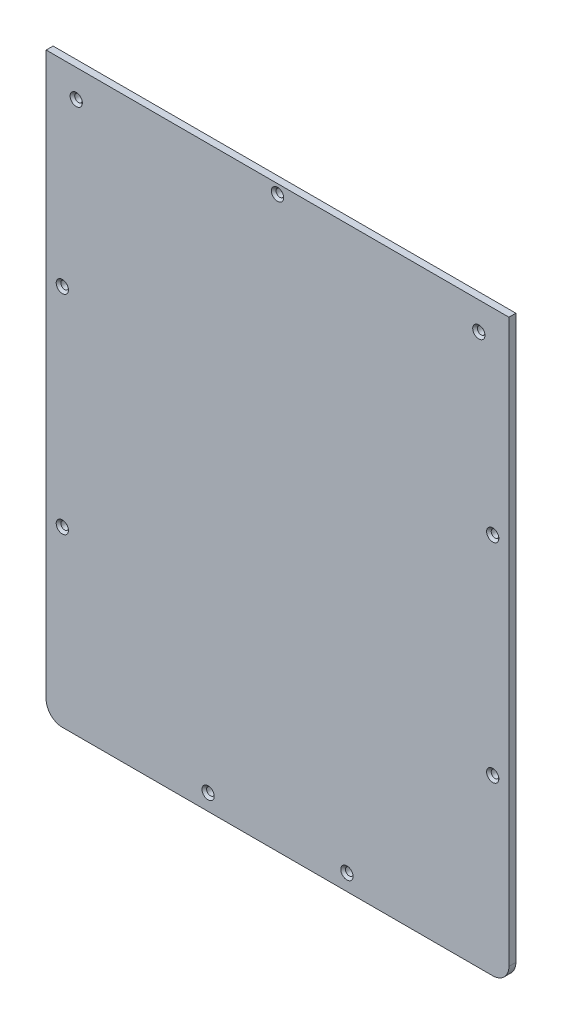
ISO-10303-21;
HEADER;
FILE_DESCRIPTION(('STEP AP214'),'2;1');
FILE_NAME('part.step','',(''),(''),'','','');
FILE_SCHEMA(('AUTOMOTIVE_DESIGN { 1 0 10303 214 1 1 1 1 }'));
ENDSEC;
DATA;
#1=APPLICATION_CONTEXT('core data for automotive mechanical design processes');
#2=APPLICATION_PROTOCOL_DEFINITION('international standard','automotive_design',2000,#1);
#3=PRODUCT_CONTEXT('',#1,'mechanical');
#4=PRODUCT('Part','Part','',(#3));
#5=PRODUCT_RELATED_PRODUCT_CATEGORY('part','',(#4));
#6=PRODUCT_DEFINITION_FORMATION('','',#4);
#7=PRODUCT_DEFINITION_CONTEXT('part definition',#1,'design');
#8=PRODUCT_DEFINITION('design','',#6,#7);
#9=PRODUCT_DEFINITION_SHAPE('','',#8);
#10=(LENGTH_UNIT() NAMED_UNIT(*) SI_UNIT(.MILLI.,.METRE.));
#11=(NAMED_UNIT(*) PLANE_ANGLE_UNIT() SI_UNIT($,.RADIAN.));
#12=(NAMED_UNIT(*) SI_UNIT($,.STERADIAN.) SOLID_ANGLE_UNIT());
#13=UNCERTAINTY_MEASURE_WITH_UNIT(LENGTH_MEASURE(1.E-05),#10,'distance_accuracy_value','');
#14=(GEOMETRIC_REPRESENTATION_CONTEXT(3) GLOBAL_UNCERTAINTY_ASSIGNED_CONTEXT((#13)) GLOBAL_UNIT_ASSIGNED_CONTEXT((#10,
#11,#12)) REPRESENTATION_CONTEXT('',''));
#15=CARTESIAN_POINT('',(0.,0.,0.));
#16=DIRECTION('',(0.,0.,1.));
#17=DIRECTION('',(1.,0.,0.));
#18=AXIS2_PLACEMENT_3D('',#15,#16,#17);
#19=CARTESIAN_POINT('',(0.,0.,3.));
#20=DIRECTION('',(1.,0.,0.));
#21=DIRECTION('',(0.,0.,-1.));
#22=AXIS2_PLACEMENT_3D('',#19,#20,#21);
#23=PLANE('',#22);
#24=DIRECTION('',(0.,-1.,0.));
#25=VECTOR('',#24,1.);
#26=CARTESIAN_POINT('',(0.,0.,0.));
#27=LINE('',#26,#25);
#28=CARTESIAN_POINT('',(0.,250.,0.));
#29=VERTEX_POINT('',#28);
#30=CARTESIAN_POINT('',(0.,7.,0.));
#31=VERTEX_POINT('',#30);
#32=EDGE_CURVE('E118',#29,#31,#27,.T.);
#33=ORIENTED_EDGE('',*,*,#32,.T.);
#34=DIRECTION('',(0.,0.,-1.));
#35=VECTOR('',#34,1.);
#36=CARTESIAN_POINT('',(0.,7.,3.));
#37=LINE('',#36,#35);
#38=CARTESIAN_POINT('',(0.,7.,3.));
#39=VERTEX_POINT('',#38);
#40=EDGE_CURVE('E48',#31,#39,#37,.F.);
#41=ORIENTED_EDGE('',*,*,#40,.T.);
#42=DIRECTION('',(0.,-1.,0.));
#43=VECTOR('',#42,1.);
#44=CARTESIAN_POINT('',(0.,0.,3.));
#45=LINE('',#44,#43);
#46=CARTESIAN_POINT('',(0.,250.,3.));
#47=VERTEX_POINT('',#46);
#48=EDGE_CURVE('E125',#47,#39,#45,.T.);
#49=ORIENTED_EDGE('',*,*,#48,.F.);
#50=DIRECTION('',(0.,0.,-1.));
#51=VECTOR('',#50,1.);
#52=CARTESIAN_POINT('',(0.,250.,3.));
#53=LINE('',#52,#51);
#54=EDGE_CURVE('E110',#47,#29,#53,.T.);
#55=ORIENTED_EDGE('',*,*,#54,.T.);
#56=EDGE_LOOP('',(#33,#41,#49,#55));
#57=FACE_BOUND('',#56,.T.);
#58=ADVANCED_FACE('F33',(#57),#23,.F.);
#59=CARTESIAN_POINT('',(0.,0.,3.));
#60=DIRECTION('',(0.,1.,0.));
#61=DIRECTION('',(0.,0.,1.));
#62=AXIS2_PLACEMENT_3D('',#59,#60,#61);
#63=PLANE('',#62);
#64=DIRECTION('',(1.,0.,0.));
#65=VECTOR('',#64,1.);
#66=CARTESIAN_POINT('',(0.,0.,0.));
#67=LINE('',#66,#65);
#68=CARTESIAN_POINT('',(7.,0.,0.));
#69=VERTEX_POINT('',#68);
#70=CARTESIAN_POINT('',(193.,0.,0.));
#71=VERTEX_POINT('',#70);
#72=EDGE_CURVE('E120',#69,#71,#67,.T.);
#73=ORIENTED_EDGE('',*,*,#72,.T.);
#74=DIRECTION('',(0.,0.,-1.));
#75=VECTOR('',#74,1.);
#76=CARTESIAN_POINT('',(193.,0.,3.));
#77=LINE('',#76,#75);
#78=CARTESIAN_POINT('',(193.,0.,3.));
#79=VERTEX_POINT('',#78);
#80=EDGE_CURVE('E56',#71,#79,#77,.F.);
#81=ORIENTED_EDGE('',*,*,#80,.T.);
#82=DIRECTION('',(1.,0.,0.));
#83=VECTOR('',#82,1.);
#84=CARTESIAN_POINT('',(0.,0.,3.));
#85=LINE('',#84,#83);
#86=CARTESIAN_POINT('',(7.,0.,3.));
#87=VERTEX_POINT('',#86);
#88=EDGE_CURVE('E100',#87,#79,#85,.T.);
#89=ORIENTED_EDGE('',*,*,#88,.F.);
#90=DIRECTION('',(0.,0.,-1.));
#91=VECTOR('',#90,1.);
#92=CARTESIAN_POINT('',(7.,0.,3.));
#93=LINE('',#92,#91);
#94=EDGE_CURVE('E132',#87,#69,#93,.T.);
#95=ORIENTED_EDGE('',*,*,#94,.T.);
#96=EDGE_LOOP('',(#73,#81,#89,#95));
#97=FACE_BOUND('',#96,.T.);
#98=ADVANCED_FACE('F207',(#97),#63,.F.);
#99=CARTESIAN_POINT('',(200.,0.,3.));
#100=DIRECTION('',(-1.,0.,0.));
#101=DIRECTION('',(0.,0.,1.));
#102=AXIS2_PLACEMENT_3D('',#99,#100,#101);
#103=PLANE('',#102);
#104=DIRECTION('',(0.,1.,0.));
#105=VECTOR('',#104,1.);
#106=CARTESIAN_POINT('',(200.,0.,3.));
#107=LINE('',#106,#105);
#108=CARTESIAN_POINT('',(200.,7.,3.));
#109=VERTEX_POINT('',#108);
#110=CARTESIAN_POINT('',(200.,250.,3.));
#111=VERTEX_POINT('',#110);
#112=EDGE_CURVE('E89',#109,#111,#107,.T.);
#113=ORIENTED_EDGE('',*,*,#112,.F.);
#114=DIRECTION('',(0.,0.,-1.));
#115=VECTOR('',#114,1.);
#116=CARTESIAN_POINT('',(200.,7.,3.));
#117=LINE('',#116,#115);
#118=CARTESIAN_POINT('',(200.,7.,0.));
#119=VERTEX_POINT('',#118);
#120=EDGE_CURVE('E109',#109,#119,#117,.T.);
#121=ORIENTED_EDGE('',*,*,#120,.T.);
#122=DIRECTION('',(0.,1.,0.));
#123=VECTOR('',#122,1.);
#124=CARTESIAN_POINT('',(200.,0.,0.));
#125=LINE('',#124,#123);
#126=CARTESIAN_POINT('',(200.,250.,0.));
#127=VERTEX_POINT('',#126);
#128=EDGE_CURVE('E106',#119,#127,#125,.T.);
#129=ORIENTED_EDGE('',*,*,#128,.T.);
#130=DIRECTION('',(0.,0.,-1.));
#131=VECTOR('',#130,1.);
#132=CARTESIAN_POINT('',(200.,250.,3.));
#133=LINE('',#132,#131);
#134=EDGE_CURVE('E103',#111,#127,#133,.T.);
#135=ORIENTED_EDGE('',*,*,#134,.F.);
#136=EDGE_LOOP('',(#113,#121,#129,#135));
#137=FACE_BOUND('',#136,.T.);
#138=ADVANCED_FACE('F104',(#137),#103,.F.);
#139=CARTESIAN_POINT('',(0.,250.,3.));
#140=DIRECTION('',(0.,-1.,0.));
#141=DIRECTION('',(0.,0.,-1.));
#142=AXIS2_PLACEMENT_3D('',#139,#140,#141);
#143=PLANE('',#142);
#144=DIRECTION('',(-1.,0.,0.));
#145=VECTOR('',#144,1.);
#146=CARTESIAN_POINT('',(0.,250.,0.));
#147=LINE('',#146,#145);
#148=EDGE_CURVE('E124',#127,#29,#147,.T.);
#149=ORIENTED_EDGE('',*,*,#148,.T.);
#150=ORIENTED_EDGE('',*,*,#54,.F.);
#151=DIRECTION('',(-1.,0.,0.));
#152=VECTOR('',#151,1.);
#153=CARTESIAN_POINT('',(0.,250.,3.));
#154=LINE('',#153,#152);
#155=EDGE_CURVE('E93',#111,#47,#154,.T.);
#156=ORIENTED_EDGE('',*,*,#155,.F.);
#157=ORIENTED_EDGE('',*,*,#134,.T.);
#158=EDGE_LOOP('',(#149,#150,#156,#157));
#159=FACE_BOUND('',#158,.T.);
#160=ADVANCED_FACE('F112',(#159),#143,.F.);
#161=CARTESIAN_POINT('',(0.,0.,3.));
#162=DIRECTION('',(0.,0.,-1.));
#163=DIRECTION('',(-1.,0.,0.));
#164=AXIS2_PLACEMENT_3D('',#161,#162,#163);
#165=PLANE('',#164);
#166=CARTESIAN_POINT('',(187.,238.,3.));
#167=DIRECTION('',(0.,0.,-1.));
#168=DIRECTION('',(-1.,0.,0.));
#169=AXIS2_PLACEMENT_3D('',#166,#167,#168);
#170=CIRCLE('',#169,2.65000000000004);
#171=CARTESIAN_POINT('',(184.35,238.,3.));
#172=VERTEX_POINT('',#171);
#173=EDGE_CURVE('E167',#172,#172,#170,.T.);
#174=ORIENTED_EDGE('',*,*,#173,.T.);
#175=EDGE_LOOP('',(#174));
#176=FACE_BOUND('',#175,.T.);
#177=CARTESIAN_POINT('',(99.9999999999999,246.,3.));
#178=DIRECTION('',(0.,0.,-1.));
#179=DIRECTION('',(-1.,0.,0.));
#180=AXIS2_PLACEMENT_3D('',#177,#178,#179);
#181=CIRCLE('',#180,2.65000000000004);
#182=CARTESIAN_POINT('',(97.3499999999999,246.,3.));
#183=VERTEX_POINT('',#182);
#184=EDGE_CURVE('E164',#183,#183,#181,.T.);
#185=ORIENTED_EDGE('',*,*,#184,.T.);
#186=EDGE_LOOP('',(#185));
#187=FACE_BOUND('',#186,.T.);
#188=CARTESIAN_POINT('',(12.9999999999999,238.,3.));
#189=DIRECTION('',(0.,0.,-1.));
#190=DIRECTION('',(-1.,0.,0.));
#191=AXIS2_PLACEMENT_3D('',#188,#189,#190);
#192=CIRCLE('',#191,2.65000000000004);
#193=CARTESIAN_POINT('',(10.3499999999999,238.,3.));
#194=VERTEX_POINT('',#193);
#195=EDGE_CURVE('E161',#194,#194,#192,.T.);
#196=ORIENTED_EDGE('',*,*,#195,.T.);
#197=EDGE_LOOP('',(#196));
#198=FACE_BOUND('',#197,.T.);
#199=CARTESIAN_POINT('',(193.,165.,3.));
#200=DIRECTION('',(0.,0.,-1.));
#201=DIRECTION('',(-1.,0.,0.));
#202=AXIS2_PLACEMENT_3D('',#199,#200,#201);
#203=CIRCLE('',#202,2.65000000000004);
#204=CARTESIAN_POINT('',(190.35,165.,3.));
#205=VERTEX_POINT('',#204);
#206=EDGE_CURVE('E158',#205,#205,#203,.T.);
#207=ORIENTED_EDGE('',*,*,#206,.T.);
#208=EDGE_LOOP('',(#207));
#209=FACE_BOUND('',#208,.T.);
#210=CARTESIAN_POINT('',(6.9999999999999,165.,3.));
#211=DIRECTION('',(0.,0.,-1.));
#212=DIRECTION('',(-1.,0.,0.));
#213=AXIS2_PLACEMENT_3D('',#210,#211,#212);
#214=CIRCLE('',#213,2.65000000000004);
#215=CARTESIAN_POINT('',(4.34999999999985,165.,3.));
#216=VERTEX_POINT('',#215);
#217=EDGE_CURVE('E155',#216,#216,#214,.T.);
#218=ORIENTED_EDGE('',*,*,#217,.T.);
#219=EDGE_LOOP('',(#218));
#220=FACE_BOUND('',#219,.T.);
#221=CARTESIAN_POINT('',(193.,75.,3.));
#222=DIRECTION('',(0.,0.,-1.));
#223=DIRECTION('',(-1.,0.,0.));
#224=AXIS2_PLACEMENT_3D('',#221,#222,#223);
#225=CIRCLE('',#224,2.64999999999996);
#226=CARTESIAN_POINT('',(190.35,75.,3.));
#227=VERTEX_POINT('',#226);
#228=EDGE_CURVE('E152',#227,#227,#225,.T.);
#229=ORIENTED_EDGE('',*,*,#228,.T.);
#230=EDGE_LOOP('',(#229));
#231=FACE_BOUND('',#230,.T.);
#232=CARTESIAN_POINT('',(6.99999999999987,75.,3.));
#233=DIRECTION('',(0.,0.,-1.));
#234=DIRECTION('',(-1.,0.,0.));
#235=AXIS2_PLACEMENT_3D('',#232,#233,#234);
#236=CIRCLE('',#235,2.64999999999996);
#237=CARTESIAN_POINT('',(4.34999999999991,75.,3.));
#238=VERTEX_POINT('',#237);
#239=EDGE_CURVE('E149',#238,#238,#236,.T.);
#240=ORIENTED_EDGE('',*,*,#239,.T.);
#241=EDGE_LOOP('',(#240));
#242=FACE_BOUND('',#241,.T.);
#243=CARTESIAN_POINT('',(130.,6.99999999999996,3.));
#244=DIRECTION('',(0.,0.,-1.));
#245=DIRECTION('',(-1.,0.,0.));
#246=AXIS2_PLACEMENT_3D('',#243,#244,#245);
#247=CIRCLE('',#246,2.65000000000004);
#248=CARTESIAN_POINT('',(127.35,6.99999999999996,3.));
#249=VERTEX_POINT('',#248);
#250=EDGE_CURVE('E146',#249,#249,#247,.T.);
#251=ORIENTED_EDGE('',*,*,#250,.T.);
#252=EDGE_LOOP('',(#251));
#253=FACE_BOUND('',#252,.T.);
#254=CARTESIAN_POINT('',(69.9999999999998,6.99999999999996,3.));
#255=DIRECTION('',(0.,0.,-1.));
#256=DIRECTION('',(-1.,0.,0.));
#257=AXIS2_PLACEMENT_3D('',#254,#255,#256);
#258=CIRCLE('',#257,2.65000000000004);
#259=CARTESIAN_POINT('',(67.3499999999998,6.99999999999996,3.));
#260=VERTEX_POINT('',#259);
#261=EDGE_CURVE('E143',#260,#260,#258,.T.);
#262=ORIENTED_EDGE('',*,*,#261,.T.);
#263=EDGE_LOOP('',(#262));
#264=FACE_BOUND('',#263,.T.);
#265=ORIENTED_EDGE('',*,*,#88,.T.);
#266=CARTESIAN_POINT('',(193.,7.,3.));
#267=DIRECTION('',(0.,0.,-1.));
#268=DIRECTION('',(-1.,0.,0.));
#269=AXIS2_PLACEMENT_3D('',#266,#267,#268);
#270=CIRCLE('',#269,7.);
#271=EDGE_CURVE('E96',#79,#109,#270,.F.);
#272=ORIENTED_EDGE('',*,*,#271,.T.);
#273=ORIENTED_EDGE('',*,*,#112,.T.);
#274=ORIENTED_EDGE('',*,*,#155,.T.);
#275=ORIENTED_EDGE('',*,*,#48,.T.);
#276=CARTESIAN_POINT('',(7.,7.,3.));
#277=DIRECTION('',(0.,0.,-1.));
#278=DIRECTION('',(-1.,0.,0.));
#279=AXIS2_PLACEMENT_3D('',#276,#277,#278);
#280=CIRCLE('',#279,7.);
#281=EDGE_CURVE('E136',#39,#87,#280,.F.);
#282=ORIENTED_EDGE('',*,*,#281,.T.);
#283=EDGE_LOOP('',(#265,#272,#273,#274,#275,#282));
#284=FACE_BOUND('',#283,.T.);
#285=ADVANCED_FACE('F91',(#176,#187,#198,#209,#220,#231,#242,#253,#264,#284),#165,.F.);
#286=CARTESIAN_POINT('',(0.,0.,0.));
#287=DIRECTION('',(0.,0.,-1.));
#288=DIRECTION('',(-1.,0.,0.));
#289=AXIS2_PLACEMENT_3D('',#286,#287,#288);
#290=PLANE('',#289);
#291=CARTESIAN_POINT('',(6.99999999999987,75.,0.));
#292=DIRECTION('',(0.,0.,1.));
#293=DIRECTION('',(1.,0.,0.));
#294=AXIS2_PLACEMENT_3D('',#291,#292,#293);
#295=CIRCLE('',#294,1.65);
#296=CARTESIAN_POINT('',(8.64999999999987,75.,0.));
#297=VERTEX_POINT('',#296);
#298=EDGE_CURVE('E264',#297,#297,#295,.T.);
#299=ORIENTED_EDGE('',*,*,#298,.T.);
#300=EDGE_LOOP('',(#299));
#301=FACE_BOUND('',#300,.T.);
#302=CARTESIAN_POINT('',(193.,75.,0.));
#303=DIRECTION('',(0.,0.,1.));
#304=DIRECTION('',(1.,0.,0.));
#305=AXIS2_PLACEMENT_3D('',#302,#303,#304);
#306=CIRCLE('',#305,1.65000000000002);
#307=CARTESIAN_POINT('',(194.65,75.,0.));
#308=VERTEX_POINT('',#307);
#309=EDGE_CURVE('E262',#308,#308,#306,.T.);
#310=ORIENTED_EDGE('',*,*,#309,.T.);
#311=EDGE_LOOP('',(#310));
#312=FACE_BOUND('',#311,.T.);
#313=CARTESIAN_POINT('',(12.9999999999999,238.,0.));
#314=DIRECTION('',(0.,0.,1.));
#315=DIRECTION('',(1.,0.,0.));
#316=AXIS2_PLACEMENT_3D('',#313,#314,#315);
#317=CIRCLE('',#316,1.65000000000001);
#318=CARTESIAN_POINT('',(14.6499999999999,238.,0.));
#319=VERTEX_POINT('',#318);
#320=EDGE_CURVE('E265',#319,#319,#317,.T.);
#321=ORIENTED_EDGE('',*,*,#320,.T.);
#322=EDGE_LOOP('',(#321));
#323=FACE_BOUND('',#322,.T.);
#324=CARTESIAN_POINT('',(99.9999999999999,246.,0.));
#325=DIRECTION('',(0.,0.,1.));
#326=DIRECTION('',(1.,0.,0.));
#327=AXIS2_PLACEMENT_3D('',#324,#325,#326);
#328=CIRCLE('',#327,1.65000000000002);
#329=CARTESIAN_POINT('',(101.65,246.,0.));
#330=VERTEX_POINT('',#329);
#331=EDGE_CURVE('E270',#330,#330,#328,.T.);
#332=ORIENTED_EDGE('',*,*,#331,.T.);
#333=EDGE_LOOP('',(#332));
#334=FACE_BOUND('',#333,.T.);
#335=CARTESIAN_POINT('',(130.,6.99999999999996,0.));
#336=DIRECTION('',(0.,0.,1.));
#337=DIRECTION('',(1.,0.,0.));
#338=AXIS2_PLACEMENT_3D('',#335,#336,#337);
#339=CIRCLE('',#338,1.65000000000002);
#340=CARTESIAN_POINT('',(131.65,6.99999999999996,0.));
#341=VERTEX_POINT('',#340);
#342=EDGE_CURVE('E459',#341,#341,#339,.T.);
#343=ORIENTED_EDGE('',*,*,#342,.T.);
#344=EDGE_LOOP('',(#343));
#345=FACE_BOUND('',#344,.T.);
#346=CARTESIAN_POINT('',(193.,165.,0.));
#347=DIRECTION('',(0.,0.,1.));
#348=DIRECTION('',(1.,0.,0.));
#349=AXIS2_PLACEMENT_3D('',#346,#347,#348);
#350=CIRCLE('',#349,1.65000000000002);
#351=CARTESIAN_POINT('',(194.65,165.,0.));
#352=VERTEX_POINT('',#351);
#353=EDGE_CURVE('E463',#352,#352,#350,.T.);
#354=ORIENTED_EDGE('',*,*,#353,.T.);
#355=EDGE_LOOP('',(#354));
#356=FACE_BOUND('',#355,.T.);
#357=CARTESIAN_POINT('',(6.9999999999999,165.,0.));
#358=DIRECTION('',(0.,0.,1.));
#359=DIRECTION('',(1.,0.,0.));
#360=AXIS2_PLACEMENT_3D('',#357,#358,#359);
#361=CIRCLE('',#360,1.65);
#362=CARTESIAN_POINT('',(8.6499999999999,165.,0.));
#363=VERTEX_POINT('',#362);
#364=EDGE_CURVE('E467',#363,#363,#361,.T.);
#365=ORIENTED_EDGE('',*,*,#364,.T.);
#366=EDGE_LOOP('',(#365));
#367=FACE_BOUND('',#366,.T.);
#368=CARTESIAN_POINT('',(187.,238.,0.));
#369=DIRECTION('',(0.,0.,1.));
#370=DIRECTION('',(1.,0.,0.));
#371=AXIS2_PLACEMENT_3D('',#368,#369,#370);
#372=CIRCLE('',#371,1.65000000000002);
#373=CARTESIAN_POINT('',(188.65,238.,0.));
#374=VERTEX_POINT('',#373);
#375=EDGE_CURVE('E276',#374,#374,#372,.T.);
#376=ORIENTED_EDGE('',*,*,#375,.T.);
#377=EDGE_LOOP('',(#376));
#378=FACE_BOUND('',#377,.T.);
#379=CARTESIAN_POINT('',(69.9999999999998,6.99999999999996,0.));
#380=DIRECTION('',(0.,0.,1.));
#381=DIRECTION('',(1.,0.,0.));
#382=AXIS2_PLACEMENT_3D('',#379,#380,#381);
#383=CIRCLE('',#382,1.65);
#384=CARTESIAN_POINT('',(71.6499999999998,6.99999999999996,0.));
#385=VERTEX_POINT('',#384);
#386=EDGE_CURVE('E121',#385,#385,#383,.T.);
#387=ORIENTED_EDGE('',*,*,#386,.T.);
#388=EDGE_LOOP('',(#387));
#389=FACE_BOUND('',#388,.T.);
#390=ORIENTED_EDGE('',*,*,#128,.F.);
#391=CARTESIAN_POINT('',(193.,7.,0.));
#392=DIRECTION('',(0.,0.,-1.));
#393=DIRECTION('',(-1.,0.,0.));
#394=AXIS2_PLACEMENT_3D('',#391,#392,#393);
#395=CIRCLE('',#394,7.);
#396=EDGE_CURVE('E130',#119,#71,#395,.T.);
#397=ORIENTED_EDGE('',*,*,#396,.T.);
#398=ORIENTED_EDGE('',*,*,#72,.F.);
#399=CARTESIAN_POINT('',(7.,7.,0.));
#400=DIRECTION('',(0.,0.,-1.));
#401=DIRECTION('',(-1.,0.,0.));
#402=AXIS2_PLACEMENT_3D('',#399,#400,#401);
#403=CIRCLE('',#402,7.);
#404=EDGE_CURVE('E128',#69,#31,#403,.T.);
#405=ORIENTED_EDGE('',*,*,#404,.T.);
#406=ORIENTED_EDGE('',*,*,#32,.F.);
#407=ORIENTED_EDGE('',*,*,#148,.F.);
#408=EDGE_LOOP('',(#390,#397,#398,#405,#406,#407));
#409=FACE_BOUND('',#408,.T.);
#410=ADVANCED_FACE('F220',(#301,#312,#323,#334,#345,#356,#367,#378,#389,#409),#290,.T.);
#411=CARTESIAN_POINT('',(193.,7.,3.));
#412=DIRECTION('',(0.,0.,-1.));
#413=DIRECTION('',(-1.,0.,0.));
#414=AXIS2_PLACEMENT_3D('',#411,#412,#413);
#415=CYLINDRICAL_SURFACE('',#414,7.);
#416=ORIENTED_EDGE('',*,*,#271,.F.);
#417=ORIENTED_EDGE('',*,*,#80,.F.);
#418=ORIENTED_EDGE('',*,*,#396,.F.);
#419=ORIENTED_EDGE('',*,*,#120,.F.);
#420=EDGE_LOOP('',(#416,#417,#418,#419));
#421=FACE_BOUND('',#420,.T.);
#422=ADVANCED_FACE('F216',(#421),#415,.T.);
#423=CARTESIAN_POINT('',(7.,7.,3.));
#424=DIRECTION('',(0.,0.,-1.));
#425=DIRECTION('',(-1.,0.,0.));
#426=AXIS2_PLACEMENT_3D('',#423,#424,#425);
#427=CYLINDRICAL_SURFACE('',#426,7.);
#428=ORIENTED_EDGE('',*,*,#281,.F.);
#429=ORIENTED_EDGE('',*,*,#40,.F.);
#430=ORIENTED_EDGE('',*,*,#404,.F.);
#431=ORIENTED_EDGE('',*,*,#94,.F.);
#432=EDGE_LOOP('',(#428,#429,#430,#431));
#433=FACE_BOUND('',#432,.T.);
#434=ADVANCED_FACE('F219',(#433),#427,.T.);
#435=CARTESIAN_POINT('',(69.9999999999998,6.99999999999996,3.));
#436=DIRECTION('',(0.,0.,-1.));
#437=DIRECTION('',(-1.,0.,0.));
#438=AXIS2_PLACEMENT_3D('',#435,#436,#437);
#439=CYLINDRICAL_SURFACE('',#438,1.65);
#440=CARTESIAN_POINT('',(69.9999999999998,6.99999999999996,1.99999999999998));
#441=DIRECTION('',(0.,0.,-1.));
#442=DIRECTION('',(-1.,0.,0.));
#443=AXIS2_PLACEMENT_3D('',#440,#441,#442);
#444=CIRCLE('',#443,1.65);
#445=CARTESIAN_POINT('',(68.3499999999998,6.99999999999996,1.99999999999998));
#446=VERTEX_POINT('',#445);
#447=EDGE_CURVE('E11',#446,#446,#444,.F.);
#448=ORIENTED_EDGE('',*,*,#447,.T.);
#449=EDGE_LOOP('',(#448));
#450=FACE_BOUND('',#449,.T.);
#451=ORIENTED_EDGE('',*,*,#386,.F.);
#452=EDGE_LOOP('',(#451));
#453=FACE_BOUND('',#452,.T.);
#454=ADVANCED_FACE('F224',(#450,#453),#439,.F.);
#455=CARTESIAN_POINT('',(187.,238.,3.));
#456=DIRECTION('',(0.,0.,-1.));
#457=DIRECTION('',(-1.,0.,0.));
#458=AXIS2_PLACEMENT_3D('',#455,#456,#457);
#459=CYLINDRICAL_SURFACE('',#458,1.65000000000002);
#460=CARTESIAN_POINT('',(187.,238.,2.));
#461=DIRECTION('',(0.,0.,-1.));
#462=DIRECTION('',(-1.,0.,0.));
#463=AXIS2_PLACEMENT_3D('',#460,#461,#462);
#464=CIRCLE('',#463,1.65000000000002);
#465=CARTESIAN_POINT('',(185.35,238.,2.));
#466=VERTEX_POINT('',#465);
#467=EDGE_CURVE('E140',#466,#466,#464,.F.);
#468=ORIENTED_EDGE('',*,*,#467,.T.);
#469=EDGE_LOOP('',(#468));
#470=FACE_BOUND('',#469,.T.);
#471=ORIENTED_EDGE('',*,*,#375,.F.);
#472=EDGE_LOOP('',(#471));
#473=FACE_BOUND('',#472,.T.);
#474=ADVANCED_FACE('F320',(#470,#473),#459,.F.);
#475=CARTESIAN_POINT('',(6.9999999999999,165.,3.));
#476=DIRECTION('',(0.,0.,-1.));
#477=DIRECTION('',(-1.,0.,0.));
#478=AXIS2_PLACEMENT_3D('',#475,#476,#477);
#479=CYLINDRICAL_SURFACE('',#478,1.65);
#480=CARTESIAN_POINT('',(6.9999999999999,165.,1.99999999999998));
#481=DIRECTION('',(0.,0.,-1.));
#482=DIRECTION('',(-1.,0.,0.));
#483=AXIS2_PLACEMENT_3D('',#480,#481,#482);
#484=CIRCLE('',#483,1.65);
#485=CARTESIAN_POINT('',(5.34999999999989,165.,1.99999999999998));
#486=VERTEX_POINT('',#485);
#487=EDGE_CURVE('E179',#486,#486,#484,.F.);
#488=ORIENTED_EDGE('',*,*,#487,.T.);
#489=EDGE_LOOP('',(#488));
#490=FACE_BOUND('',#489,.T.);
#491=ORIENTED_EDGE('',*,*,#364,.F.);
#492=EDGE_LOOP('',(#491));
#493=FACE_BOUND('',#492,.T.);
#494=ADVANCED_FACE('F326',(#490,#493),#479,.F.);
#495=CARTESIAN_POINT('',(193.,165.,3.));
#496=DIRECTION('',(0.,0.,-1.));
#497=DIRECTION('',(-1.,0.,0.));
#498=AXIS2_PLACEMENT_3D('',#495,#496,#497);
#499=CYLINDRICAL_SURFACE('',#498,1.65000000000002);
#500=CARTESIAN_POINT('',(193.,165.,2.));
#501=DIRECTION('',(0.,0.,-1.));
#502=DIRECTION('',(-1.,0.,0.));
#503=AXIS2_PLACEMENT_3D('',#500,#501,#502);
#504=CIRCLE('',#503,1.65000000000002);
#505=CARTESIAN_POINT('',(191.35,165.,2.));
#506=VERTEX_POINT('',#505);
#507=EDGE_CURVE('E176',#506,#506,#504,.F.);
#508=ORIENTED_EDGE('',*,*,#507,.T.);
#509=EDGE_LOOP('',(#508));
#510=FACE_BOUND('',#509,.T.);
#511=ORIENTED_EDGE('',*,*,#353,.F.);
#512=EDGE_LOOP('',(#511));
#513=FACE_BOUND('',#512,.T.);
#514=ADVANCED_FACE('F334',(#510,#513),#499,.F.);
#515=CARTESIAN_POINT('',(130.,6.99999999999996,3.));
#516=DIRECTION('',(0.,0.,-1.));
#517=DIRECTION('',(-1.,0.,0.));
#518=AXIS2_PLACEMENT_3D('',#515,#516,#517);
#519=CYLINDRICAL_SURFACE('',#518,1.65000000000002);
#520=CARTESIAN_POINT('',(130.,6.99999999999996,2.));
#521=DIRECTION('',(0.,0.,-1.));
#522=DIRECTION('',(-1.,0.,0.));
#523=AXIS2_PLACEMENT_3D('',#520,#521,#522);
#524=CIRCLE('',#523,1.65000000000002);
#525=CARTESIAN_POINT('',(128.35,6.99999999999996,2.));
#526=VERTEX_POINT('',#525);
#527=EDGE_CURVE('E41',#526,#526,#524,.F.);
#528=ORIENTED_EDGE('',*,*,#527,.T.);
#529=EDGE_LOOP('',(#528));
#530=FACE_BOUND('',#529,.T.);
#531=ORIENTED_EDGE('',*,*,#342,.F.);
#532=EDGE_LOOP('',(#531));
#533=FACE_BOUND('',#532,.T.);
#534=ADVANCED_FACE('F190',(#530,#533),#519,.F.);
#535=CARTESIAN_POINT('',(99.9999999999999,246.,3.));
#536=DIRECTION('',(0.,0.,-1.));
#537=DIRECTION('',(-1.,0.,0.));
#538=AXIS2_PLACEMENT_3D('',#535,#536,#537);
#539=CYLINDRICAL_SURFACE('',#538,1.65000000000002);
#540=CARTESIAN_POINT('',(99.9999999999999,246.,2.));
#541=DIRECTION('',(0.,0.,-1.));
#542=DIRECTION('',(-1.,0.,0.));
#543=AXIS2_PLACEMENT_3D('',#540,#541,#542);
#544=CIRCLE('',#543,1.65000000000002);
#545=CARTESIAN_POINT('',(98.3499999999999,246.,2.));
#546=VERTEX_POINT('',#545);
#547=EDGE_CURVE('E170',#546,#546,#544,.F.);
#548=ORIENTED_EDGE('',*,*,#547,.T.);
#549=EDGE_LOOP('',(#548));
#550=FACE_BOUND('',#549,.T.);
#551=ORIENTED_EDGE('',*,*,#331,.F.);
#552=EDGE_LOOP('',(#551));
#553=FACE_BOUND('',#552,.T.);
#554=ADVANCED_FACE('F349',(#550,#553),#539,.F.);
#555=CARTESIAN_POINT('',(12.9999999999999,238.,3.));
#556=DIRECTION('',(0.,0.,-1.));
#557=DIRECTION('',(-1.,0.,0.));
#558=AXIS2_PLACEMENT_3D('',#555,#556,#557);
#559=CYLINDRICAL_SURFACE('',#558,1.65000000000001);
#560=CARTESIAN_POINT('',(12.9999999999999,238.,1.99999999999999));
#561=DIRECTION('',(0.,0.,-1.));
#562=DIRECTION('',(-1.,0.,0.));
#563=AXIS2_PLACEMENT_3D('',#560,#561,#562);
#564=CIRCLE('',#563,1.65000000000001);
#565=CARTESIAN_POINT('',(11.3499999999999,238.,1.99999999999999));
#566=VERTEX_POINT('',#565);
#567=EDGE_CURVE('E173',#566,#566,#564,.F.);
#568=ORIENTED_EDGE('',*,*,#567,.T.);
#569=EDGE_LOOP('',(#568));
#570=FACE_BOUND('',#569,.T.);
#571=ORIENTED_EDGE('',*,*,#320,.F.);
#572=EDGE_LOOP('',(#571));
#573=FACE_BOUND('',#572,.T.);
#574=ADVANCED_FACE('F258',(#570,#573),#559,.F.);
#575=CARTESIAN_POINT('',(193.,75.,3.));
#576=DIRECTION('',(0.,0.,-1.));
#577=DIRECTION('',(-1.,0.,0.));
#578=AXIS2_PLACEMENT_3D('',#575,#576,#577);
#579=CYLINDRICAL_SURFACE('',#578,1.65000000000002);
#580=CARTESIAN_POINT('',(193.,75.,2.00000000000008));
#581=DIRECTION('',(0.,0.,-1.));
#582=DIRECTION('',(-1.,0.,0.));
#583=AXIS2_PLACEMENT_3D('',#580,#581,#582);
#584=CIRCLE('',#583,1.65000000000002);
#585=CARTESIAN_POINT('',(191.35,75.,2.00000000000008));
#586=VERTEX_POINT('',#585);
#587=EDGE_CURVE('E182',#586,#586,#584,.F.);
#588=ORIENTED_EDGE('',*,*,#587,.T.);
#589=EDGE_LOOP('',(#588));
#590=FACE_BOUND('',#589,.T.);
#591=ORIENTED_EDGE('',*,*,#309,.F.);
#592=EDGE_LOOP('',(#591));
#593=FACE_BOUND('',#592,.T.);
#594=ADVANCED_FACE('F255',(#590,#593),#579,.F.);
#595=CARTESIAN_POINT('',(6.99999999999987,75.,3.));
#596=DIRECTION('',(0.,0.,-1.));
#597=DIRECTION('',(-1.,0.,0.));
#598=AXIS2_PLACEMENT_3D('',#595,#596,#597);
#599=CYLINDRICAL_SURFACE('',#598,1.65);
#600=CARTESIAN_POINT('',(6.99999999999987,75.,2.00000000000006));
#601=DIRECTION('',(0.,0.,-1.));
#602=DIRECTION('',(-1.,0.,0.));
#603=AXIS2_PLACEMENT_3D('',#600,#601,#602);
#604=CIRCLE('',#603,1.65);
#605=CARTESIAN_POINT('',(5.34999999999987,75.,2.00000000000006));
#606=VERTEX_POINT('',#605);
#607=EDGE_CURVE('E185',#606,#606,#604,.F.);
#608=ORIENTED_EDGE('',*,*,#607,.T.);
#609=EDGE_LOOP('',(#608));
#610=FACE_BOUND('',#609,.T.);
#611=ORIENTED_EDGE('',*,*,#298,.F.);
#612=EDGE_LOOP('',(#611));
#613=FACE_BOUND('',#612,.T.);
#614=ADVANCED_FACE('F230',(#610,#613),#599,.F.);
#615=CARTESIAN_POINT('',(187.,238.,2.));
#616=DIRECTION('',(0.,0.,1.));
#617=DIRECTION('',(1.,0.,0.));
#618=AXIS2_PLACEMENT_3D('',#615,#616,#617);
#619=CONICAL_SURFACE('',#618,1.65000000000002,0.785398163397459);
#620=ORIENTED_EDGE('',*,*,#173,.F.);
#621=EDGE_LOOP('',(#620));
#622=FACE_BOUND('',#621,.T.);
#623=ORIENTED_EDGE('',*,*,#467,.F.);
#624=EDGE_LOOP('',(#623));
#625=FACE_BOUND('',#624,.T.);
#626=ADVANCED_FACE('F226',(#622,#625),#619,.F.);
#627=CARTESIAN_POINT('',(99.9999999999999,246.,2.));
#628=DIRECTION('',(0.,0.,1.));
#629=DIRECTION('',(1.,0.,0.));
#630=AXIS2_PLACEMENT_3D('',#627,#628,#629);
#631=CONICAL_SURFACE('',#630,1.65000000000002,0.785398163397459);
#632=ORIENTED_EDGE('',*,*,#184,.F.);
#633=EDGE_LOOP('',(#632));
#634=FACE_BOUND('',#633,.T.);
#635=ORIENTED_EDGE('',*,*,#547,.F.);
#636=EDGE_LOOP('',(#635));
#637=FACE_BOUND('',#636,.T.);
#638=ADVANCED_FACE('F229',(#634,#637),#631,.F.);
#639=CARTESIAN_POINT('',(12.9999999999999,238.,1.99999999999999));
#640=DIRECTION('',(0.,0.,1.));
#641=DIRECTION('',(1.,0.,0.));
#642=AXIS2_PLACEMENT_3D('',#639,#640,#641);
#643=CONICAL_SURFACE('',#642,1.65000000000001,0.785398163397459);
#644=ORIENTED_EDGE('',*,*,#195,.F.);
#645=EDGE_LOOP('',(#644));
#646=FACE_BOUND('',#645,.T.);
#647=ORIENTED_EDGE('',*,*,#567,.F.);
#648=EDGE_LOOP('',(#647));
#649=FACE_BOUND('',#648,.T.);
#650=ADVANCED_FACE('F234',(#646,#649),#643,.F.);
#651=CARTESIAN_POINT('',(193.,165.,2.));
#652=DIRECTION('',(0.,0.,1.));
#653=DIRECTION('',(1.,0.,0.));
#654=AXIS2_PLACEMENT_3D('',#651,#652,#653);
#655=CONICAL_SURFACE('',#654,1.65000000000002,0.785398163397459);
#656=ORIENTED_EDGE('',*,*,#206,.F.);
#657=EDGE_LOOP('',(#656));
#658=FACE_BOUND('',#657,.T.);
#659=ORIENTED_EDGE('',*,*,#507,.F.);
#660=EDGE_LOOP('',(#659));
#661=FACE_BOUND('',#660,.T.);
#662=ADVANCED_FACE('F238',(#658,#661),#655,.F.);
#663=CARTESIAN_POINT('',(6.9999999999999,165.,1.99999999999998));
#664=DIRECTION('',(0.,0.,1.));
#665=DIRECTION('',(1.,0.,0.));
#666=AXIS2_PLACEMENT_3D('',#663,#664,#665);
#667=CONICAL_SURFACE('',#666,1.65,0.785398163397459);
#668=ORIENTED_EDGE('',*,*,#217,.F.);
#669=EDGE_LOOP('',(#668));
#670=FACE_BOUND('',#669,.T.);
#671=ORIENTED_EDGE('',*,*,#487,.F.);
#672=EDGE_LOOP('',(#671));
#673=FACE_BOUND('',#672,.T.);
#674=ADVANCED_FACE('F242',(#670,#673),#667,.F.);
#675=CARTESIAN_POINT('',(193.,75.,2.00000000000008));
#676=DIRECTION('',(0.,0.,1.));
#677=DIRECTION('',(1.,0.,0.));
#678=AXIS2_PLACEMENT_3D('',#675,#676,#677);
#679=CONICAL_SURFACE('',#678,1.65000000000002,0.785398163397459);
#680=ORIENTED_EDGE('',*,*,#228,.F.);
#681=EDGE_LOOP('',(#680));
#682=FACE_BOUND('',#681,.T.);
#683=ORIENTED_EDGE('',*,*,#587,.F.);
#684=EDGE_LOOP('',(#683));
#685=FACE_BOUND('',#684,.T.);
#686=ADVANCED_FACE('F202',(#682,#685),#679,.F.);
#687=CARTESIAN_POINT('',(6.99999999999987,75.,2.00000000000006));
#688=DIRECTION('',(0.,0.,1.));
#689=DIRECTION('',(1.,0.,0.));
#690=AXIS2_PLACEMENT_3D('',#687,#688,#689);
#691=CONICAL_SURFACE('',#690,1.65,0.785398163397459);
#692=ORIENTED_EDGE('',*,*,#239,.F.);
#693=EDGE_LOOP('',(#692));
#694=FACE_BOUND('',#693,.T.);
#695=ORIENTED_EDGE('',*,*,#607,.F.);
#696=EDGE_LOOP('',(#695));
#697=FACE_BOUND('',#696,.T.);
#698=ADVANCED_FACE('F195',(#694,#697),#691,.F.);
#699=CARTESIAN_POINT('',(130.,6.99999999999996,2.));
#700=DIRECTION('',(0.,0.,1.));
#701=DIRECTION('',(1.,0.,0.));
#702=AXIS2_PLACEMENT_3D('',#699,#700,#701);
#703=CONICAL_SURFACE('',#702,1.65000000000002,0.785398163397459);
#704=ORIENTED_EDGE('',*,*,#250,.F.);
#705=EDGE_LOOP('',(#704));
#706=FACE_BOUND('',#705,.T.);
#707=ORIENTED_EDGE('',*,*,#527,.F.);
#708=EDGE_LOOP('',(#707));
#709=FACE_BOUND('',#708,.T.);
#710=ADVANCED_FACE('F193',(#706,#709),#703,.F.);
#711=CARTESIAN_POINT('',(69.9999999999998,6.99999999999996,1.99999999999998));
#712=DIRECTION('',(0.,0.,1.));
#713=DIRECTION('',(1.,0.,0.));
#714=AXIS2_PLACEMENT_3D('',#711,#712,#713);
#715=CONICAL_SURFACE('',#714,1.65,0.785398163397459);
#716=ORIENTED_EDGE('',*,*,#261,.F.);
#717=EDGE_LOOP('',(#716));
#718=FACE_BOUND('',#717,.T.);
#719=ORIENTED_EDGE('',*,*,#447,.F.);
#720=EDGE_LOOP('',(#719));
#721=FACE_BOUND('',#720,.T.);
#722=ADVANCED_FACE('F35',(#718,#721),#715,.F.);
#723=CLOSED_SHELL('',(#58,#98,#138,#160,#285,#410,#422,#434,#454,#474,#494,#514,#534,#554,#574,
#594,#614,#626,#638,#650,#662,#674,#686,#698,#710,#722));
#724=MANIFOLD_SOLID_BREP('B2',#723);
#725=ADVANCED_BREP_SHAPE_REPRESENTATION('',(#18,#724),#14);
#726=SHAPE_DEFINITION_REPRESENTATION(#9,#725);
ENDSEC;
END-ISO-10303-21;
